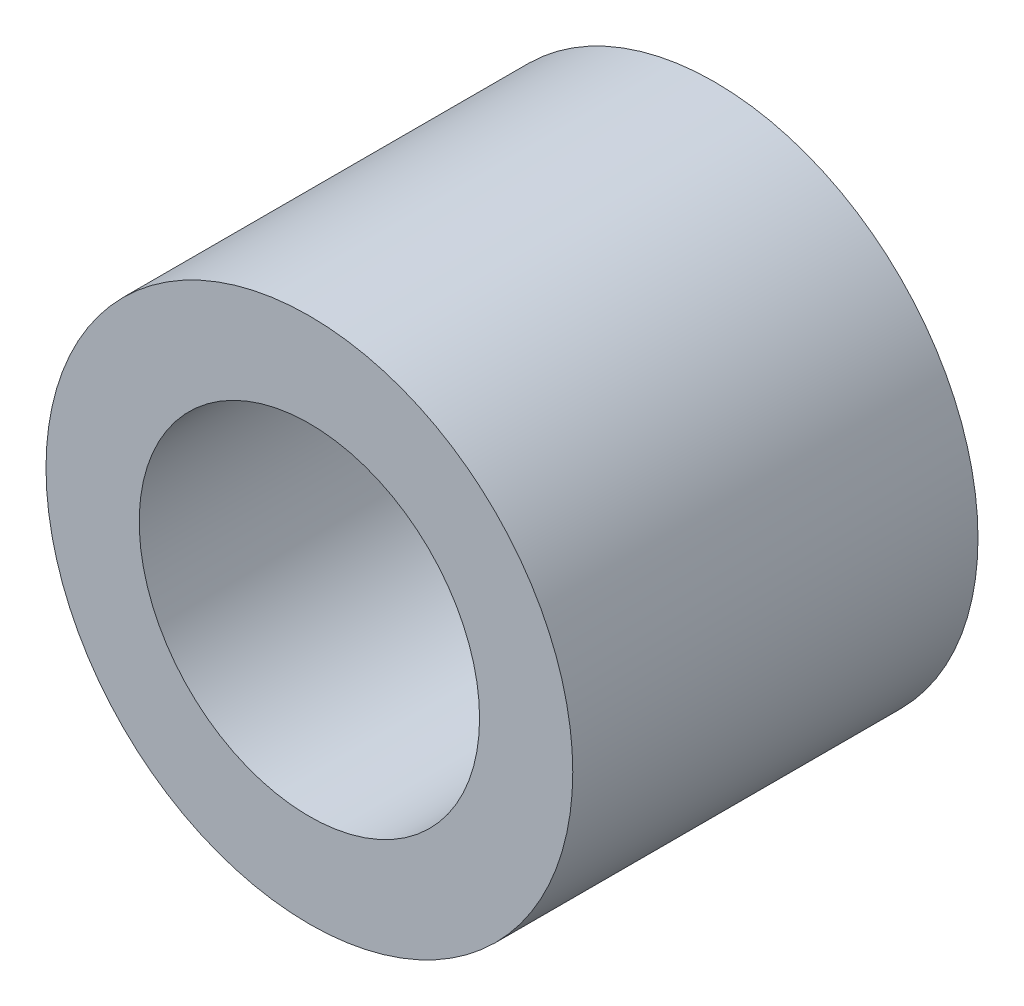
ISO-10303-21;
HEADER;
FILE_DESCRIPTION(('STEP AP214'),'2;1');
FILE_NAME('part.step','',(''),(''),'','','');
FILE_SCHEMA(('AUTOMOTIVE_DESIGN { 1 0 10303 214 1 1 1 1 }'));
ENDSEC;
DATA;
#1=APPLICATION_CONTEXT('core data for automotive mechanical design processes');
#2=APPLICATION_PROTOCOL_DEFINITION('international standard','automotive_design',2000,#1);
#3=PRODUCT_CONTEXT('',#1,'mechanical');
#4=PRODUCT('Part','Part','',(#3));
#5=PRODUCT_RELATED_PRODUCT_CATEGORY('part','',(#4));
#6=PRODUCT_DEFINITION_FORMATION('','',#4);
#7=PRODUCT_DEFINITION_CONTEXT('part definition',#1,'design');
#8=PRODUCT_DEFINITION('design','',#6,#7);
#9=PRODUCT_DEFINITION_SHAPE('','',#8);
#10=(LENGTH_UNIT() NAMED_UNIT(*) SI_UNIT(.MILLI.,.METRE.));
#11=(NAMED_UNIT(*) PLANE_ANGLE_UNIT() SI_UNIT($,.RADIAN.));
#12=(NAMED_UNIT(*) SI_UNIT($,.STERADIAN.) SOLID_ANGLE_UNIT());
#13=UNCERTAINTY_MEASURE_WITH_UNIT(LENGTH_MEASURE(1.E-05),#10,'distance_accuracy_value','');
#14=(GEOMETRIC_REPRESENTATION_CONTEXT(3) GLOBAL_UNCERTAINTY_ASSIGNED_CONTEXT((#13)) GLOBAL_UNIT_ASSIGNED_CONTEXT((#10,
#11,#12)) REPRESENTATION_CONTEXT('',''));
#15=CARTESIAN_POINT('',(0.,0.,0.));
#16=DIRECTION('',(0.,0.,1.));
#17=DIRECTION('',(1.,0.,0.));
#18=AXIS2_PLACEMENT_3D('',#15,#16,#17);
#19=CARTESIAN_POINT('',(0.,0.,-1.));
#20=DIRECTION('',(0.,0.,1.));
#21=DIRECTION('',(1.,0.,0.));
#22=AXIS2_PLACEMENT_3D('',#19,#20,#21);
#23=CYLINDRICAL_SURFACE('',#22,3.25);
#24=CARTESIAN_POINT('',(0.,0.,-1.));
#25=DIRECTION('',(0.,0.,1.));
#26=DIRECTION('',(1.,0.,0.));
#27=AXIS2_PLACEMENT_3D('',#24,#25,#26);
#28=CIRCLE('',#27,3.25);
#29=CARTESIAN_POINT('',(3.25,0.,-1.));
#30=VERTEX_POINT('',#29);
#31=EDGE_CURVE('E39',#30,#30,#28,.T.);
#32=ORIENTED_EDGE('',*,*,#31,.T.);
#33=EDGE_LOOP('',(#32));
#34=FACE_BOUND('',#33,.T.);
#35=CARTESIAN_POINT('',(0.,0.,4.));
#36=DIRECTION('',(0.,0.,1.));
#37=DIRECTION('',(1.,0.,0.));
#38=AXIS2_PLACEMENT_3D('',#35,#36,#37);
#39=CIRCLE('',#38,3.25);
#40=CARTESIAN_POINT('',(3.25,0.,4.));
#41=VERTEX_POINT('',#40);
#42=EDGE_CURVE('E43',#41,#41,#39,.T.);
#43=ORIENTED_EDGE('',*,*,#42,.F.);
#44=EDGE_LOOP('',(#43));
#45=FACE_BOUND('',#44,.T.);
#46=ADVANCED_FACE('F33',(#34,#45),#23,.T.);
#47=CARTESIAN_POINT('',(0.,0.,-1.));
#48=DIRECTION('',(0.,0.,1.));
#49=DIRECTION('',(1.,0.,0.));
#50=AXIS2_PLACEMENT_3D('',#47,#48,#49);
#51=PLANE('',#50);
#52=ORIENTED_EDGE('',*,*,#31,.F.);
#53=EDGE_LOOP('',(#52));
#54=FACE_BOUND('',#53,.T.);
#55=ADVANCED_FACE('F57',(#54),#51,.F.);
#56=CARTESIAN_POINT('',(0.,0.,4.));
#57=DIRECTION('',(0.,0.,1.));
#58=DIRECTION('',(1.,0.,0.));
#59=AXIS2_PLACEMENT_3D('',#56,#57,#58);
#60=PLANE('',#59);
#61=ORIENTED_EDGE('',*,*,#42,.T.);
#62=EDGE_LOOP('',(#61));
#63=FACE_BOUND('',#62,.T.);
#64=CARTESIAN_POINT('',(0.,0.,4.));
#65=DIRECTION('',(0.,0.,1.));
#66=DIRECTION('',(1.,0.,0.));
#67=AXIS2_PLACEMENT_3D('',#64,#65,#66);
#68=CIRCLE('',#67,2.1);
#69=CARTESIAN_POINT('',(2.1,0.,4.));
#70=VERTEX_POINT('',#69);
#71=EDGE_CURVE('E47',#70,#70,#68,.T.);
#72=ORIENTED_EDGE('',*,*,#71,.F.);
#73=EDGE_LOOP('',(#72));
#74=FACE_BOUND('',#73,.T.);
#75=ADVANCED_FACE('F55',(#63,#74),#60,.T.);
#76=CARTESIAN_POINT('',(0.,0.,4.));
#77=DIRECTION('',(0.,0.,-1.));
#78=DIRECTION('',(-1.,0.,0.));
#79=AXIS2_PLACEMENT_3D('',#76,#77,#78);
#80=CYLINDRICAL_SURFACE('',#79,2.1);
#81=ORIENTED_EDGE('',*,*,#71,.T.);
#82=EDGE_LOOP('',(#81));
#83=FACE_BOUND('',#82,.T.);
#84=CARTESIAN_POINT('',(0.,0.,0.));
#85=DIRECTION('',(0.,0.,1.));
#86=DIRECTION('',(1.,0.,0.));
#87=AXIS2_PLACEMENT_3D('',#84,#85,#86);
#88=CIRCLE('',#87,2.1);
#89=CARTESIAN_POINT('',(2.1,0.,0.));
#90=VERTEX_POINT('',#89);
#91=EDGE_CURVE('E10',#90,#90,#88,.F.);
#92=ORIENTED_EDGE('',*,*,#91,.T.);
#93=EDGE_LOOP('',(#92));
#94=FACE_BOUND('',#93,.T.);
#95=ADVANCED_FACE('F53',(#83,#94),#80,.F.);
#96=CARTESIAN_POINT('',(0.,0.,0.));
#97=DIRECTION('',(0.,0.,1.));
#98=DIRECTION('',(1.,0.,0.));
#99=AXIS2_PLACEMENT_3D('',#96,#97,#98);
#100=PLANE('',#99);
#101=ORIENTED_EDGE('',*,*,#91,.F.);
#102=EDGE_LOOP('',(#101));
#103=FACE_BOUND('',#102,.T.);
#104=ADVANCED_FACE('F64',(#103),#100,.T.);
#105=CLOSED_SHELL('',(#46,#55,#75,#95,#104));
#106=MANIFOLD_SOLID_BREP('B2',#105);
#107=ADVANCED_BREP_SHAPE_REPRESENTATION('',(#18,#106),#14);
#108=SHAPE_DEFINITION_REPRESENTATION(#9,#107);
ENDSEC;
END-ISO-10303-21;
